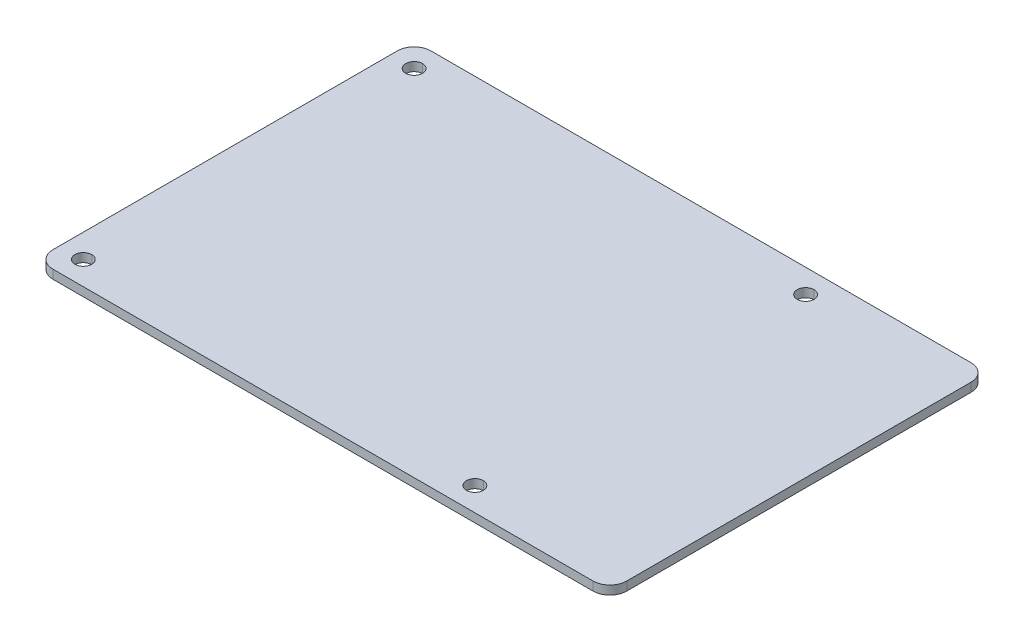
ISO-10303-21;
HEADER;
FILE_DESCRIPTION(('STEP AP214'),'2;1');
FILE_NAME('part.step','',(''),(''),'','','');
FILE_SCHEMA(('AUTOMOTIVE_DESIGN { 1 0 10303 214 1 1 1 1 }'));
ENDSEC;
DATA;
#1=APPLICATION_CONTEXT('core data for automotive mechanical design processes');
#2=APPLICATION_PROTOCOL_DEFINITION('international standard','automotive_design',2000,#1);
#3=PRODUCT_CONTEXT('',#1,'mechanical');
#4=PRODUCT('Part','Part','',(#3));
#5=PRODUCT_RELATED_PRODUCT_CATEGORY('part','',(#4));
#6=PRODUCT_DEFINITION_FORMATION('','',#4);
#7=PRODUCT_DEFINITION_CONTEXT('part definition',#1,'design');
#8=PRODUCT_DEFINITION('design','',#6,#7);
#9=PRODUCT_DEFINITION_SHAPE('','',#8);
#10=(LENGTH_UNIT() NAMED_UNIT(*) SI_UNIT(.MILLI.,.METRE.));
#11=(NAMED_UNIT(*) PLANE_ANGLE_UNIT() SI_UNIT($,.RADIAN.));
#12=(NAMED_UNIT(*) SI_UNIT($,.STERADIAN.) SOLID_ANGLE_UNIT());
#13=UNCERTAINTY_MEASURE_WITH_UNIT(LENGTH_MEASURE(1.E-05),#10,'distance_accuracy_value','');
#14=(GEOMETRIC_REPRESENTATION_CONTEXT(3) GLOBAL_UNCERTAINTY_ASSIGNED_CONTEXT((#13)) GLOBAL_UNIT_ASSIGNED_CONTEXT((#10,
#11,#12)) REPRESENTATION_CONTEXT('',''));
#15=CARTESIAN_POINT('',(0.,0.,0.));
#16=DIRECTION('',(0.,0.,1.));
#17=DIRECTION('',(1.,0.,0.));
#18=AXIS2_PLACEMENT_3D('',#15,#16,#17);
#19=CARTESIAN_POINT('',(18.9999999999601,-1.3,24.499999999993));
#20=DIRECTION('',(0.,1.,0.));
#21=DIRECTION('',(0.,0.,1.));
#22=AXIS2_PLACEMENT_3D('',#19,#20,#21);
#23=CYLINDRICAL_SURFACE('',#22,1.24999999998654);
#24=CARTESIAN_POINT('',(18.9999999999601,-1.3,24.499999999993));
#25=DIRECTION('',(0.,1.,0.));
#26=DIRECTION('',(0.,0.,-1.));
#27=AXIS2_PLACEMENT_3D('',#24,#25,#26);
#28=CIRCLE('',#27,1.24999999998654);
#29=CARTESIAN_POINT('',(18.9999999999601,-1.3,23.2500000000064));
#30=VERTEX_POINT('',#29);
#31=CARTESIAN_POINT('',(18.9999999999601,-1.3,25.7499999999795));
#32=VERTEX_POINT('',#31);
#33=EDGE_CURVE('E42',#30,#32,#28,.T.);
#34=ORIENTED_EDGE('',*,*,#33,.F.);
#35=DIRECTION('',(0.,1.,0.));
#36=VECTOR('',#35,1.);
#37=CARTESIAN_POINT('',(18.9999999999601,-1.3,23.2500000000064));
#38=LINE('',#37,#36);
#39=CARTESIAN_POINT('',(18.9999999999601,0.,23.2500000000064));
#40=VERTEX_POINT('',#39);
#41=EDGE_CURVE('E11',#30,#40,#38,.T.);
#42=ORIENTED_EDGE('',*,*,#41,.T.);
#43=CARTESIAN_POINT('',(18.9999999999601,0.,24.499999999993));
#44=DIRECTION('',(0.,1.,0.));
#45=DIRECTION('',(0.,0.,-1.));
#46=AXIS2_PLACEMENT_3D('',#43,#44,#45);
#47=CIRCLE('',#46,1.24999999998654);
#48=CARTESIAN_POINT('',(18.9999999999601,0.,25.7499999999795));
#49=VERTEX_POINT('',#48);
#50=EDGE_CURVE('E28',#40,#49,#47,.T.);
#51=ORIENTED_EDGE('',*,*,#50,.T.);
#52=DIRECTION('',(0.,1.,0.));
#53=VECTOR('',#52,1.);
#54=CARTESIAN_POINT('',(18.9999999999601,-1.3,25.7499999999795));
#55=LINE('',#54,#53);
#56=EDGE_CURVE('E263',#32,#49,#55,.T.);
#57=ORIENTED_EDGE('',*,*,#56,.F.);
#58=EDGE_LOOP('',(#34,#42,#51,#57));
#59=FACE_BOUND('',#58,.T.);
#60=ADVANCED_FACE('F17',(#59),#23,.F.);
#61=CARTESIAN_POINT('',(-39.0000000000399,-1.3,24.4999999999304));
#62=DIRECTION('',(0.,1.,0.));
#63=DIRECTION('',(0.,0.,1.));
#64=AXIS2_PLACEMENT_3D('',#61,#62,#63);
#65=CYLINDRICAL_SURFACE('',#64,1.24999999998655);
#66=CARTESIAN_POINT('',(-39.0000000000399,-1.3,24.4999999999304));
#67=DIRECTION('',(0.,1.,0.));
#68=DIRECTION('',(0.,0.,-1.));
#69=AXIS2_PLACEMENT_3D('',#66,#67,#68);
#70=CIRCLE('',#69,1.24999999998655);
#71=CARTESIAN_POINT('',(-39.0000000000399,-1.3,23.2499999999438));
#72=VERTEX_POINT('',#71);
#73=CARTESIAN_POINT('',(-39.0000000000399,-1.3,25.749999999917));
#74=VERTEX_POINT('',#73);
#75=EDGE_CURVE('E62',#72,#74,#70,.T.);
#76=ORIENTED_EDGE('',*,*,#75,.F.);
#77=DIRECTION('',(0.,1.,0.));
#78=VECTOR('',#77,1.);
#79=CARTESIAN_POINT('',(-39.0000000000399,-1.3,23.2499999999438));
#80=LINE('',#79,#78);
#81=CARTESIAN_POINT('',(-39.0000000000399,0.,23.2499999999438));
#82=VERTEX_POINT('',#81);
#83=EDGE_CURVE('E281',#72,#82,#80,.T.);
#84=ORIENTED_EDGE('',*,*,#83,.T.);
#85=CARTESIAN_POINT('',(-39.0000000000399,0.,24.4999999999304));
#86=DIRECTION('',(0.,1.,0.));
#87=DIRECTION('',(0.,0.,-1.));
#88=AXIS2_PLACEMENT_3D('',#85,#86,#87);
#89=CIRCLE('',#88,1.24999999998655);
#90=CARTESIAN_POINT('',(-39.0000000000399,0.,25.749999999917));
#91=VERTEX_POINT('',#90);
#92=EDGE_CURVE('E77',#82,#91,#89,.T.);
#93=ORIENTED_EDGE('',*,*,#92,.T.);
#94=DIRECTION('',(0.,1.,0.));
#95=VECTOR('',#94,1.);
#96=CARTESIAN_POINT('',(-39.0000000000399,-1.3,25.749999999917));
#97=LINE('',#96,#95);
#98=EDGE_CURVE('E262',#74,#91,#97,.T.);
#99=ORIENTED_EDGE('',*,*,#98,.F.);
#100=EDGE_LOOP('',(#76,#84,#93,#99));
#101=FACE_BOUND('',#100,.T.);
#102=ADVANCED_FACE('F19',(#101),#65,.F.);
#103=CARTESIAN_POINT('',(-38.9999999999871,-1.3,-24.5000000000556));
#104=DIRECTION('',(0.,1.,0.));
#105=DIRECTION('',(0.,0.,1.));
#106=AXIS2_PLACEMENT_3D('',#103,#104,#105);
#107=CYLINDRICAL_SURFACE('',#106,1.24999999998659);
#108=CARTESIAN_POINT('',(-38.9999999999871,-1.3,-24.5000000000556));
#109=DIRECTION('',(0.,1.,0.));
#110=DIRECTION('',(0.,0.,-1.));
#111=AXIS2_PLACEMENT_3D('',#108,#109,#110);
#112=CIRCLE('',#111,1.24999999998659);
#113=CARTESIAN_POINT('',(-38.9999999999871,-1.3,-25.7500000000421));
#114=VERTEX_POINT('',#113);
#115=CARTESIAN_POINT('',(-38.9999999999871,-1.3,-23.2500000000689));
#116=VERTEX_POINT('',#115);
#117=EDGE_CURVE('E215',#114,#116,#112,.T.);
#118=ORIENTED_EDGE('',*,*,#117,.F.);
#119=DIRECTION('',(0.,1.,0.));
#120=VECTOR('',#119,1.);
#121=CARTESIAN_POINT('',(-38.9999999999871,-1.3,-25.7500000000421));
#122=LINE('',#121,#120);
#123=CARTESIAN_POINT('',(-38.9999999999871,0.,-25.7500000000421));
#124=VERTEX_POINT('',#123);
#125=EDGE_CURVE('E252',#114,#124,#122,.T.);
#126=ORIENTED_EDGE('',*,*,#125,.T.);
#127=CARTESIAN_POINT('',(-38.9999999999871,0.,-24.5000000000556));
#128=DIRECTION('',(0.,1.,0.));
#129=DIRECTION('',(0.,0.,-1.));
#130=AXIS2_PLACEMENT_3D('',#127,#128,#129);
#131=CIRCLE('',#130,1.24999999998659);
#132=CARTESIAN_POINT('',(-38.9999999999871,0.,-23.2500000000689));
#133=VERTEX_POINT('',#132);
#134=EDGE_CURVE('E248',#124,#133,#131,.T.);
#135=ORIENTED_EDGE('',*,*,#134,.T.);
#136=DIRECTION('',(0.,1.,0.));
#137=VECTOR('',#136,1.);
#138=CARTESIAN_POINT('',(-38.9999999999871,-1.3,-23.2500000000689));
#139=LINE('',#138,#137);
#140=EDGE_CURVE('E269',#116,#133,#139,.T.);
#141=ORIENTED_EDGE('',*,*,#140,.F.);
#142=EDGE_LOOP('',(#118,#126,#135,#141));
#143=FACE_BOUND('',#142,.T.);
#144=ADVANCED_FACE('F426',(#143),#107,.F.);
#145=CARTESIAN_POINT('',(19.000000000013,-1.3,-24.499999999993));
#146=DIRECTION('',(0.,1.,0.));
#147=DIRECTION('',(0.,0.,1.));
#148=AXIS2_PLACEMENT_3D('',#145,#146,#147);
#149=CYLINDRICAL_SURFACE('',#148,1.24999999998654);
#150=CARTESIAN_POINT('',(19.000000000013,-1.3,-24.499999999993));
#151=DIRECTION('',(0.,1.,0.));
#152=DIRECTION('',(0.,0.,-1.));
#153=AXIS2_PLACEMENT_3D('',#150,#151,#152);
#154=CIRCLE('',#153,1.24999999998654);
#155=CARTESIAN_POINT('',(19.000000000013,-1.3,-25.7499999999796));
#156=VERTEX_POINT('',#155);
#157=CARTESIAN_POINT('',(19.000000000013,-1.3,-23.2500000000064));
#158=VERTEX_POINT('',#157);
#159=EDGE_CURVE('E213',#156,#158,#154,.T.);
#160=ORIENTED_EDGE('',*,*,#159,.F.);
#161=DIRECTION('',(0.,1.,0.));
#162=VECTOR('',#161,1.);
#163=CARTESIAN_POINT('',(19.000000000013,-1.3,-25.7499999999796));
#164=LINE('',#163,#162);
#165=CARTESIAN_POINT('',(19.000000000013,0.,-25.7499999999796));
#166=VERTEX_POINT('',#165);
#167=EDGE_CURVE('E253',#156,#166,#164,.T.);
#168=ORIENTED_EDGE('',*,*,#167,.T.);
#169=CARTESIAN_POINT('',(19.000000000013,0.,-24.499999999993));
#170=DIRECTION('',(0.,1.,0.));
#171=DIRECTION('',(0.,0.,-1.));
#172=AXIS2_PLACEMENT_3D('',#169,#170,#171);
#173=CIRCLE('',#172,1.24999999998654);
#174=CARTESIAN_POINT('',(19.000000000013,0.,-23.2500000000064));
#175=VERTEX_POINT('',#174);
#176=EDGE_CURVE('E455',#166,#175,#173,.T.);
#177=ORIENTED_EDGE('',*,*,#176,.T.);
#178=DIRECTION('',(0.,1.,0.));
#179=VECTOR('',#178,1.);
#180=CARTESIAN_POINT('',(19.000000000013,-1.3,-23.2500000000064));
#181=LINE('',#180,#179);
#182=EDGE_CURVE('E280',#158,#175,#181,.T.);
#183=ORIENTED_EDGE('',*,*,#182,.F.);
#184=EDGE_LOOP('',(#160,#168,#177,#183));
#185=FACE_BOUND('',#184,.T.);
#186=ADVANCED_FACE('F456',(#185),#149,.F.);
#187=CARTESIAN_POINT('',(39.9999999999724,-1.3,25.5000000000431));
#188=DIRECTION('',(0.,1.,0.));
#189=DIRECTION('',(0.,0.,1.));
#190=AXIS2_PLACEMENT_3D('',#187,#188,#189);
#191=CYLINDRICAL_SURFACE('',#190,2.5);
#192=CARTESIAN_POINT('',(39.9999999999724,0.,25.5000000000431));
#193=DIRECTION('',(0.,1.,0.));
#194=DIRECTION('',(0.,0.,1.));
#195=AXIS2_PLACEMENT_3D('',#192,#193,#194);
#196=CIRCLE('',#195,2.5);
#197=CARTESIAN_POINT('',(39.9999999999697,0.,28.0000000000432));
#198=VERTEX_POINT('',#197);
#199=CARTESIAN_POINT('',(42.4999999999725,0.,25.5000000000458));
#200=VERTEX_POINT('',#199);
#201=EDGE_CURVE('E211',#198,#200,#196,.T.);
#202=ORIENTED_EDGE('',*,*,#201,.F.);
#203=DIRECTION('',(0.,1.,0.));
#204=VECTOR('',#203,1.);
#205=CARTESIAN_POINT('',(39.9999999999697,-1.3,28.0000000000432));
#206=LINE('',#205,#204);
#207=CARTESIAN_POINT('',(39.9999999999697,-1.3,28.0000000000432));
#208=VERTEX_POINT('',#207);
#209=EDGE_CURVE('E333',#208,#198,#206,.T.);
#210=ORIENTED_EDGE('',*,*,#209,.F.);
#211=CARTESIAN_POINT('',(39.9999999999724,-1.3,25.5000000000431));
#212=DIRECTION('',(0.,1.,0.));
#213=DIRECTION('',(0.,0.,1.));
#214=AXIS2_PLACEMENT_3D('',#211,#212,#213);
#215=CIRCLE('',#214,2.5);
#216=CARTESIAN_POINT('',(42.4999999999725,-1.3,25.5000000000458));
#217=VERTEX_POINT('',#216);
#218=EDGE_CURVE('E301',#208,#217,#215,.T.);
#219=ORIENTED_EDGE('',*,*,#218,.T.);
#220=DIRECTION('',(0.,1.,0.));
#221=VECTOR('',#220,1.);
#222=CARTESIAN_POINT('',(42.4999999999725,-1.3,25.5000000000458));
#223=LINE('',#222,#221);
#224=EDGE_CURVE('E197',#217,#200,#223,.T.);
#225=ORIENTED_EDGE('',*,*,#224,.T.);
#226=EDGE_LOOP('',(#202,#210,#219,#225));
#227=FACE_BOUND('',#226,.T.);
#228=ADVANCED_FACE('F494',(#227),#191,.T.);
#229=CARTESIAN_POINT('',(-40.0000000000302,-1.3,27.9999999999568));
#230=DIRECTION('',(0.,0.,1.));
#231=DIRECTION('',(1.,1.07938831483967E-12,0.));
#232=AXIS2_PLACEMENT_3D('',#229,#230,#231);
#233=PLANE('',#232);
#234=DIRECTION('',(1.,0.,1.07938831483967E-12));
#235=VECTOR('',#234,1.);
#236=CARTESIAN_POINT('',(-40.0000000000302,0.,27.9999999999568));
#237=LINE('',#236,#235);
#238=CARTESIAN_POINT('',(-40.0000000000302,0.,27.9999999999568));
#239=VERTEX_POINT('',#238);
#240=EDGE_CURVE('E247',#239,#198,#237,.T.);
#241=ORIENTED_EDGE('',*,*,#240,.F.);
#242=DIRECTION('',(0.,1.,0.));
#243=VECTOR('',#242,1.);
#244=CARTESIAN_POINT('',(-40.0000000000302,-1.3,27.9999999999568));
#245=LINE('',#244,#243);
#246=CARTESIAN_POINT('',(-40.0000000000302,-1.3,27.9999999999568));
#247=VERTEX_POINT('',#246);
#248=EDGE_CURVE('E284',#247,#239,#245,.T.);
#249=ORIENTED_EDGE('',*,*,#248,.F.);
#250=DIRECTION('',(1.,0.,1.07938831483967E-12));
#251=VECTOR('',#250,1.);
#252=CARTESIAN_POINT('',(-40.0000000000302,-1.3,27.9999999999568));
#253=LINE('',#252,#251);
#254=EDGE_CURVE('E302',#247,#208,#253,.T.);
#255=ORIENTED_EDGE('',*,*,#254,.T.);
#256=ORIENTED_EDGE('',*,*,#209,.T.);
#257=EDGE_LOOP('',(#241,#249,#255,#256));
#258=FACE_BOUND('',#257,.T.);
#259=ADVANCED_FACE('F355',(#258),#233,.T.);
#260=CARTESIAN_POINT('',(-40.0000000000275,-1.3,25.4999999999568));
#261=DIRECTION('',(0.,1.,0.));
#262=DIRECTION('',(0.,0.,1.));
#263=AXIS2_PLACEMENT_3D('',#260,#261,#262);
#264=CYLINDRICAL_SURFACE('',#263,2.5);
#265=CARTESIAN_POINT('',(-40.0000000000275,0.,25.4999999999568));
#266=DIRECTION('',(0.,1.,0.));
#267=DIRECTION('',(0.,0.,1.));
#268=AXIS2_PLACEMENT_3D('',#265,#266,#267);
#269=CIRCLE('',#268,2.5);
#270=CARTESIAN_POINT('',(-42.5000000000275,0.,25.4999999999541));
#271=VERTEX_POINT('',#270);
#272=EDGE_CURVE('E244',#271,#239,#269,.T.);
#273=ORIENTED_EDGE('',*,*,#272,.F.);
#274=DIRECTION('',(0.,1.,0.));
#275=VECTOR('',#274,1.);
#276=CARTESIAN_POINT('',(-42.5000000000275,-1.3,25.4999999999541));
#277=LINE('',#276,#275);
#278=CARTESIAN_POINT('',(-42.5000000000275,-1.3,25.4999999999541));
#279=VERTEX_POINT('',#278);
#280=EDGE_CURVE('E275',#279,#271,#277,.T.);
#281=ORIENTED_EDGE('',*,*,#280,.F.);
#282=CARTESIAN_POINT('',(-40.0000000000275,-1.3,25.4999999999568));
#283=DIRECTION('',(0.,1.,0.));
#284=DIRECTION('',(0.,0.,1.));
#285=AXIS2_PLACEMENT_3D('',#282,#283,#284);
#286=CIRCLE('',#285,2.5);
#287=EDGE_CURVE('E287',#279,#247,#286,.T.);
#288=ORIENTED_EDGE('',*,*,#287,.T.);
#289=ORIENTED_EDGE('',*,*,#248,.T.);
#290=EDGE_LOOP('',(#273,#281,#288,#289));
#291=FACE_BOUND('',#290,.T.);
#292=ADVANCED_FACE('F361',(#291),#264,.T.);
#293=CARTESIAN_POINT('',(-42.4999999999725,-1.3,-25.5000000000458));
#294=DIRECTION('',(-1.,0.,-1.07933814391561E-12));
#295=DIRECTION('',(-1.07933814391561E-12,0.,1.));
#296=AXIS2_PLACEMENT_3D('',#293,#294,#295);
#297=PLANE('',#296);
#298=DIRECTION('',(-1.07933814391561E-12,0.,1.));
#299=VECTOR('',#298,1.);
#300=CARTESIAN_POINT('',(-42.4999999999725,0.,-25.5000000000458));
#301=LINE('',#300,#299);
#302=CARTESIAN_POINT('',(-42.4999999999725,0.,-25.5000000000458));
#303=VERTEX_POINT('',#302);
#304=EDGE_CURVE('E209',#303,#271,#301,.T.);
#305=ORIENTED_EDGE('',*,*,#304,.F.);
#306=DIRECTION('',(0.,1.,0.));
#307=VECTOR('',#306,1.);
#308=CARTESIAN_POINT('',(-42.4999999999725,-1.3,-25.5000000000458));
#309=LINE('',#308,#307);
#310=CARTESIAN_POINT('',(-42.4999999999725,-1.3,-25.5000000000458));
#311=VERTEX_POINT('',#310);
#312=EDGE_CURVE('E264',#311,#303,#309,.T.);
#313=ORIENTED_EDGE('',*,*,#312,.F.);
#314=DIRECTION('',(-1.07933814391561E-12,0.,1.));
#315=VECTOR('',#314,1.);
#316=CARTESIAN_POINT('',(-42.4999999999725,-1.3,-25.5000000000458));
#317=LINE('',#316,#315);
#318=EDGE_CURVE('E288',#311,#279,#317,.T.);
#319=ORIENTED_EDGE('',*,*,#318,.T.);
#320=ORIENTED_EDGE('',*,*,#280,.T.);
#321=EDGE_LOOP('',(#305,#313,#319,#320));
#322=FACE_BOUND('',#321,.T.);
#323=ADVANCED_FACE('F573',(#322),#297,.T.);
#324=CARTESIAN_POINT('',(-39.9999999999725,-1.3,-25.5000000000431));
#325=DIRECTION('',(0.,1.,0.));
#326=DIRECTION('',(0.,0.,1.));
#327=AXIS2_PLACEMENT_3D('',#324,#325,#326);
#328=CYLINDRICAL_SURFACE('',#327,2.5);
#329=CARTESIAN_POINT('',(-39.9999999999725,0.,-25.5000000000431));
#330=DIRECTION('',(0.,1.,0.));
#331=DIRECTION('',(0.,0.,1.));
#332=AXIS2_PLACEMENT_3D('',#329,#330,#331);
#333=CIRCLE('',#332,2.5);
#334=CARTESIAN_POINT('',(-39.9999999999697,0.,-28.0000000000432));
#335=VERTEX_POINT('',#334);
#336=EDGE_CURVE('E254',#335,#303,#333,.T.);
#337=ORIENTED_EDGE('',*,*,#336,.F.);
#338=DIRECTION('',(0.,1.,0.));
#339=VECTOR('',#338,1.);
#340=CARTESIAN_POINT('',(-39.9999999999697,-1.3,-28.0000000000432));
#341=LINE('',#340,#339);
#342=CARTESIAN_POINT('',(-39.9999999999697,-1.3,-28.0000000000432));
#343=VERTEX_POINT('',#342);
#344=EDGE_CURVE('E193',#343,#335,#341,.T.);
#345=ORIENTED_EDGE('',*,*,#344,.F.);
#346=CARTESIAN_POINT('',(-39.9999999999725,-1.3,-25.5000000000431));
#347=DIRECTION('',(0.,1.,0.));
#348=DIRECTION('',(0.,0.,1.));
#349=AXIS2_PLACEMENT_3D('',#346,#347,#348);
#350=CIRCLE('',#349,2.5);
#351=EDGE_CURVE('E268',#343,#311,#350,.T.);
#352=ORIENTED_EDGE('',*,*,#351,.T.);
#353=ORIENTED_EDGE('',*,*,#312,.T.);
#354=EDGE_LOOP('',(#337,#345,#352,#353));
#355=FACE_BOUND('',#354,.T.);
#356=ADVANCED_FACE('F479',(#355),#328,.T.);
#357=CARTESIAN_POINT('',(40.0000000000302,-1.3,-27.9999999999568));
#358=DIRECTION('',(1.07908473823137E-12,0.,-1.));
#359=DIRECTION('',(0.,-1.,0.));
#360=AXIS2_PLACEMENT_3D('',#357,#358,#359);
#361=PLANE('',#360);
#362=DIRECTION('',(-1.,0.,-1.07908473823137E-12));
#363=VECTOR('',#362,1.);
#364=CARTESIAN_POINT('',(40.0000000000302,0.,-27.9999999999568));
#365=LINE('',#364,#363);
#366=CARTESIAN_POINT('',(40.0000000000302,0.,-27.9999999999568));
#367=VERTEX_POINT('',#366);
#368=EDGE_CURVE('E156',#367,#335,#365,.T.);
#369=ORIENTED_EDGE('',*,*,#368,.F.);
#370=DIRECTION('',(0.,1.,0.));
#371=VECTOR('',#370,1.);
#372=CARTESIAN_POINT('',(40.0000000000302,-1.3,-27.9999999999568));
#373=LINE('',#372,#371);
#374=CARTESIAN_POINT('',(40.0000000000302,-1.3,-27.9999999999568));
#375=VERTEX_POINT('',#374);
#376=EDGE_CURVE('E146',#375,#367,#373,.T.);
#377=ORIENTED_EDGE('',*,*,#376,.F.);
#378=DIRECTION('',(-1.,0.,-1.07908473823137E-12));
#379=VECTOR('',#378,1.);
#380=CARTESIAN_POINT('',(40.0000000000302,-1.3,-27.9999999999568));
#381=LINE('',#380,#379);
#382=EDGE_CURVE('E191',#375,#343,#381,.T.);
#383=ORIENTED_EDGE('',*,*,#382,.T.);
#384=ORIENTED_EDGE('',*,*,#344,.T.);
#385=EDGE_LOOP('',(#369,#377,#383,#384));
#386=FACE_BOUND('',#385,.T.);
#387=ADVANCED_FACE('F487',(#386),#361,.T.);
#388=CARTESIAN_POINT('',(40.0000000000275,-1.3,-25.4999999999568));
#389=DIRECTION('',(0.,1.,0.));
#390=DIRECTION('',(0.,0.,1.));
#391=AXIS2_PLACEMENT_3D('',#388,#389,#390);
#392=CYLINDRICAL_SURFACE('',#391,2.5);
#393=CARTESIAN_POINT('',(40.0000000000275,0.,-25.4999999999568));
#394=DIRECTION('',(0.,1.,0.));
#395=DIRECTION('',(0.,0.,1.));
#396=AXIS2_PLACEMENT_3D('',#393,#394,#395);
#397=CIRCLE('',#396,2.5);
#398=CARTESIAN_POINT('',(42.5000000000275,0.,-25.4999999999541));
#399=VERTEX_POINT('',#398);
#400=EDGE_CURVE('E176',#399,#367,#397,.T.);
#401=ORIENTED_EDGE('',*,*,#400,.F.);
#402=DIRECTION('',(0.,1.,0.));
#403=VECTOR('',#402,1.);
#404=CARTESIAN_POINT('',(42.5000000000275,-1.3,-25.4999999999541));
#405=LINE('',#404,#403);
#406=CARTESIAN_POINT('',(42.5000000000275,-1.3,-25.4999999999541));
#407=VERTEX_POINT('',#406);
#408=EDGE_CURVE('E171',#407,#399,#405,.T.);
#409=ORIENTED_EDGE('',*,*,#408,.F.);
#410=CARTESIAN_POINT('',(40.0000000000275,-1.3,-25.4999999999568));
#411=DIRECTION('',(0.,1.,0.));
#412=DIRECTION('',(0.,0.,1.));
#413=AXIS2_PLACEMENT_3D('',#410,#411,#412);
#414=CIRCLE('',#413,2.5);
#415=EDGE_CURVE('E174',#407,#375,#414,.T.);
#416=ORIENTED_EDGE('',*,*,#415,.T.);
#417=ORIENTED_EDGE('',*,*,#376,.T.);
#418=EDGE_LOOP('',(#401,#409,#416,#417));
#419=FACE_BOUND('',#418,.T.);
#420=ADVANCED_FACE('F173',(#419),#392,.T.);
#421=CARTESIAN_POINT('',(42.4999999999725,-1.3,25.5000000000458));
#422=DIRECTION('',(1.,0.,0.));
#423=DIRECTION('',(0.,-1.07920208717239E-12,1.));
#424=AXIS2_PLACEMENT_3D('',#421,#422,#423);
#425=PLANE('',#424);
#426=DIRECTION('',(1.07920208717239E-12,0.,-1.));
#427=VECTOR('',#426,1.);
#428=CARTESIAN_POINT('',(42.4999999999725,0.,25.5000000000458));
#429=LINE('',#428,#427);
#430=EDGE_CURVE('E214',#200,#399,#429,.T.);
#431=ORIENTED_EDGE('',*,*,#430,.F.);
#432=ORIENTED_EDGE('',*,*,#224,.F.);
#433=DIRECTION('',(1.07920208717239E-12,0.,-1.));
#434=VECTOR('',#433,1.);
#435=CARTESIAN_POINT('',(42.4999999999725,-1.3,25.5000000000458));
#436=LINE('',#435,#434);
#437=EDGE_CURVE('E182',#217,#407,#436,.T.);
#438=ORIENTED_EDGE('',*,*,#437,.T.);
#439=ORIENTED_EDGE('',*,*,#408,.T.);
#440=EDGE_LOOP('',(#431,#432,#438,#439));
#441=FACE_BOUND('',#440,.T.);
#442=ADVANCED_FACE('F195',(#441),#425,.T.);
#443=CARTESIAN_POINT('',(39.9999999999724,-1.3,25.5000000000431));
#444=DIRECTION('',(0.,1.,0.));
#445=DIRECTION('',(1.,0.,0.));
#446=AXIS2_PLACEMENT_3D('',#443,#444,#445);
#447=PLANE('',#446);
#448=ORIENTED_EDGE('',*,*,#218,.F.);
#449=ORIENTED_EDGE('',*,*,#254,.F.);
#450=ORIENTED_EDGE('',*,*,#287,.F.);
#451=ORIENTED_EDGE('',*,*,#318,.F.);
#452=ORIENTED_EDGE('',*,*,#351,.F.);
#453=ORIENTED_EDGE('',*,*,#382,.F.);
#454=ORIENTED_EDGE('',*,*,#415,.F.);
#455=ORIENTED_EDGE('',*,*,#437,.F.);
#456=EDGE_LOOP('',(#448,#449,#450,#451,#452,#453,#454,#455));
#457=FACE_BOUND('',#456,.T.);
#458=CARTESIAN_POINT('',(18.9999999999601,-1.3,24.499999999993));
#459=DIRECTION('',(0.,1.,0.));
#460=DIRECTION('',(0.,0.,-1.));
#461=AXIS2_PLACEMENT_3D('',#458,#459,#460);
#462=CIRCLE('',#461,1.24999999998654);
#463=EDGE_CURVE('E183',#32,#30,#462,.T.);
#464=ORIENTED_EDGE('',*,*,#463,.T.);
#465=ORIENTED_EDGE('',*,*,#33,.T.);
#466=EDGE_LOOP('',(#464,#465));
#467=FACE_BOUND('',#466,.T.);
#468=CARTESIAN_POINT('',(-39.0000000000399,-1.3,24.4999999999304));
#469=DIRECTION('',(0.,1.,0.));
#470=DIRECTION('',(0.,0.,-1.));
#471=AXIS2_PLACEMENT_3D('',#468,#469,#470);
#472=CIRCLE('',#471,1.24999999998655);
#473=EDGE_CURVE('E340',#74,#72,#472,.T.);
#474=ORIENTED_EDGE('',*,*,#473,.T.);
#475=ORIENTED_EDGE('',*,*,#75,.T.);
#476=EDGE_LOOP('',(#474,#475));
#477=FACE_BOUND('',#476,.T.);
#478=CARTESIAN_POINT('',(-38.9999999999871,-1.3,-24.5000000000556));
#479=DIRECTION('',(0.,1.,0.));
#480=DIRECTION('',(0.,0.,-1.));
#481=AXIS2_PLACEMENT_3D('',#478,#479,#480);
#482=CIRCLE('',#481,1.24999999998659);
#483=EDGE_CURVE('E218',#116,#114,#482,.T.);
#484=ORIENTED_EDGE('',*,*,#483,.T.);
#485=ORIENTED_EDGE('',*,*,#117,.T.);
#486=EDGE_LOOP('',(#484,#485));
#487=FACE_BOUND('',#486,.T.);
#488=CARTESIAN_POINT('',(19.000000000013,-1.3,-24.499999999993));
#489=DIRECTION('',(0.,1.,0.));
#490=DIRECTION('',(0.,0.,-1.));
#491=AXIS2_PLACEMENT_3D('',#488,#489,#490);
#492=CIRCLE('',#491,1.24999999998654);
#493=EDGE_CURVE('E219',#158,#156,#492,.T.);
#494=ORIENTED_EDGE('',*,*,#493,.T.);
#495=ORIENTED_EDGE('',*,*,#159,.T.);
#496=EDGE_LOOP('',(#494,#495));
#497=FACE_BOUND('',#496,.T.);
#498=ADVANCED_FACE('F188',(#457,#467,#477,#487,#497),#447,.F.);
#499=CARTESIAN_POINT('',(39.9999999999724,0.,25.5000000000431));
#500=DIRECTION('',(0.,1.,0.));
#501=DIRECTION('',(1.,0.,0.));
#502=AXIS2_PLACEMENT_3D('',#499,#500,#501);
#503=PLANE('',#502);
#504=ORIENTED_EDGE('',*,*,#201,.T.);
#505=ORIENTED_EDGE('',*,*,#430,.T.);
#506=ORIENTED_EDGE('',*,*,#400,.T.);
#507=ORIENTED_EDGE('',*,*,#368,.T.);
#508=ORIENTED_EDGE('',*,*,#336,.T.);
#509=ORIENTED_EDGE('',*,*,#304,.T.);
#510=ORIENTED_EDGE('',*,*,#272,.T.);
#511=ORIENTED_EDGE('',*,*,#240,.T.);
#512=EDGE_LOOP('',(#504,#505,#506,#507,#508,#509,#510,#511));
#513=FACE_BOUND('',#512,.T.);
#514=CARTESIAN_POINT('',(18.9999999999601,0.,24.499999999993));
#515=DIRECTION('',(0.,1.,0.));
#516=DIRECTION('',(0.,0.,-1.));
#517=AXIS2_PLACEMENT_3D('',#514,#515,#516);
#518=CIRCLE('',#517,1.24999999998654);
#519=EDGE_CURVE('E290',#49,#40,#518,.T.);
#520=ORIENTED_EDGE('',*,*,#519,.F.);
#521=ORIENTED_EDGE('',*,*,#50,.F.);
#522=EDGE_LOOP('',(#520,#521));
#523=FACE_BOUND('',#522,.T.);
#524=CARTESIAN_POINT('',(-39.0000000000399,0.,24.4999999999304));
#525=DIRECTION('',(0.,1.,0.));
#526=DIRECTION('',(0.,0.,-1.));
#527=AXIS2_PLACEMENT_3D('',#524,#525,#526);
#528=CIRCLE('',#527,1.24999999998655);
#529=EDGE_CURVE('E258',#91,#82,#528,.T.);
#530=ORIENTED_EDGE('',*,*,#529,.F.);
#531=ORIENTED_EDGE('',*,*,#92,.F.);
#532=EDGE_LOOP('',(#530,#531));
#533=FACE_BOUND('',#532,.T.);
#534=CARTESIAN_POINT('',(-38.9999999999871,0.,-24.5000000000556));
#535=DIRECTION('',(0.,1.,0.));
#536=DIRECTION('',(0.,0.,-1.));
#537=AXIS2_PLACEMENT_3D('',#534,#535,#536);
#538=CIRCLE('',#537,1.24999999998659);
#539=EDGE_CURVE('E21',#133,#124,#538,.T.);
#540=ORIENTED_EDGE('',*,*,#539,.F.);
#541=ORIENTED_EDGE('',*,*,#134,.F.);
#542=EDGE_LOOP('',(#540,#541));
#543=FACE_BOUND('',#542,.T.);
#544=CARTESIAN_POINT('',(19.000000000013,0.,-24.499999999993));
#545=DIRECTION('',(0.,1.,0.));
#546=DIRECTION('',(0.,0.,-1.));
#547=AXIS2_PLACEMENT_3D('',#544,#545,#546);
#548=CIRCLE('',#547,1.24999999998654);
#549=EDGE_CURVE('E272',#175,#166,#548,.T.);
#550=ORIENTED_EDGE('',*,*,#549,.F.);
#551=ORIENTED_EDGE('',*,*,#176,.F.);
#552=EDGE_LOOP('',(#550,#551));
#553=FACE_BOUND('',#552,.T.);
#554=ADVANCED_FACE('F460',(#513,#523,#533,#543,#553),#503,.T.);
#555=CARTESIAN_POINT('',(19.000000000013,-1.3,-24.499999999993));
#556=DIRECTION('',(0.,1.,0.));
#557=DIRECTION('',(0.,0.,1.));
#558=AXIS2_PLACEMENT_3D('',#555,#556,#557);
#559=CYLINDRICAL_SURFACE('',#558,1.24999999998654);
#560=ORIENTED_EDGE('',*,*,#167,.F.);
#561=ORIENTED_EDGE('',*,*,#493,.F.);
#562=ORIENTED_EDGE('',*,*,#182,.T.);
#563=ORIENTED_EDGE('',*,*,#549,.T.);
#564=EDGE_LOOP('',(#560,#561,#562,#563));
#565=FACE_BOUND('',#564,.T.);
#566=ADVANCED_FACE('F451',(#565),#559,.F.);
#567=CARTESIAN_POINT('',(-38.9999999999871,-1.3,-24.5000000000556));
#568=DIRECTION('',(0.,1.,0.));
#569=DIRECTION('',(0.,0.,1.));
#570=AXIS2_PLACEMENT_3D('',#567,#568,#569);
#571=CYLINDRICAL_SURFACE('',#570,1.24999999998659);
#572=ORIENTED_EDGE('',*,*,#125,.F.);
#573=ORIENTED_EDGE('',*,*,#483,.F.);
#574=ORIENTED_EDGE('',*,*,#140,.T.);
#575=ORIENTED_EDGE('',*,*,#539,.T.);
#576=EDGE_LOOP('',(#572,#573,#574,#575));
#577=FACE_BOUND('',#576,.T.);
#578=ADVANCED_FACE('F432',(#577),#571,.F.);
#579=CARTESIAN_POINT('',(-39.0000000000399,-1.3,24.4999999999304));
#580=DIRECTION('',(0.,1.,0.));
#581=DIRECTION('',(0.,0.,1.));
#582=AXIS2_PLACEMENT_3D('',#579,#580,#581);
#583=CYLINDRICAL_SURFACE('',#582,1.24999999998655);
#584=ORIENTED_EDGE('',*,*,#83,.F.);
#585=ORIENTED_EDGE('',*,*,#473,.F.);
#586=ORIENTED_EDGE('',*,*,#98,.T.);
#587=ORIENTED_EDGE('',*,*,#529,.T.);
#588=EDGE_LOOP('',(#584,#585,#586,#587));
#589=FACE_BOUND('',#588,.T.);
#590=ADVANCED_FACE('F488',(#589),#583,.F.);
#591=CARTESIAN_POINT('',(18.9999999999601,-1.3,24.499999999993));
#592=DIRECTION('',(0.,1.,0.));
#593=DIRECTION('',(0.,0.,1.));
#594=AXIS2_PLACEMENT_3D('',#591,#592,#593);
#595=CYLINDRICAL_SURFACE('',#594,1.24999999998654);
#596=ORIENTED_EDGE('',*,*,#41,.F.);
#597=ORIENTED_EDGE('',*,*,#463,.F.);
#598=ORIENTED_EDGE('',*,*,#56,.T.);
#599=ORIENTED_EDGE('',*,*,#519,.T.);
#600=EDGE_LOOP('',(#596,#597,#598,#599));
#601=FACE_BOUND('',#600,.T.);
#602=ADVANCED_FACE('F491',(#601),#595,.F.);
#603=CLOSED_SHELL('',(#60,#102,#144,#186,#228,#259,#292,#323,#356,#387,#420,#442,#498,#554,#566,
#578,#590,#602));
#604=MANIFOLD_SOLID_BREP('B1',#603);
#605=ADVANCED_BREP_SHAPE_REPRESENTATION('',(#18,#604),#14);
#606=SHAPE_DEFINITION_REPRESENTATION(#9,#605);
ENDSEC;
END-ISO-10303-21;
